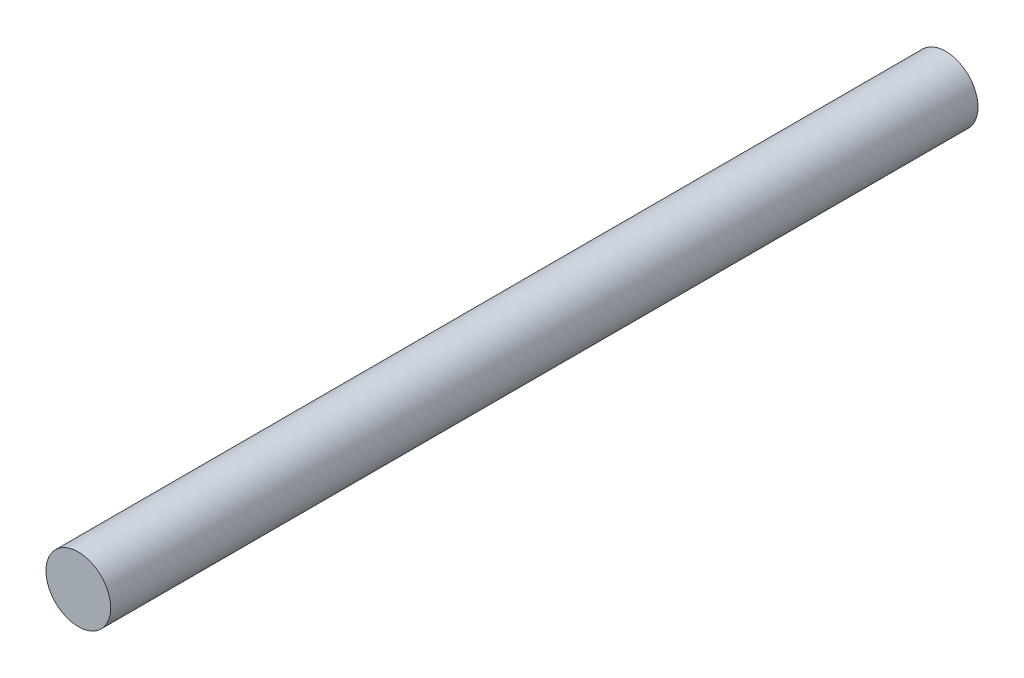
ISO-10303-21;
HEADER;
FILE_DESCRIPTION(('STEP AP214'),'2;1');
FILE_NAME('part.step','',(''),(''),'','','');
FILE_SCHEMA(('AUTOMOTIVE_DESIGN { 1 0 10303 214 1 1 1 1 }'));
ENDSEC;
DATA;
#1=APPLICATION_CONTEXT('core data for automotive mechanical design processes');
#2=APPLICATION_PROTOCOL_DEFINITION('international standard','automotive_design',2000,#1);
#3=PRODUCT_CONTEXT('',#1,'mechanical');
#4=PRODUCT('Part','Part','',(#3));
#5=PRODUCT_RELATED_PRODUCT_CATEGORY('part','',(#4));
#6=PRODUCT_DEFINITION_FORMATION('','',#4);
#7=PRODUCT_DEFINITION_CONTEXT('part definition',#1,'design');
#8=PRODUCT_DEFINITION('design','',#6,#7);
#9=PRODUCT_DEFINITION_SHAPE('','',#8);
#10=(LENGTH_UNIT() NAMED_UNIT(*) SI_UNIT(.MILLI.,.METRE.));
#11=(NAMED_UNIT(*) PLANE_ANGLE_UNIT() SI_UNIT($,.RADIAN.));
#12=(NAMED_UNIT(*) SI_UNIT($,.STERADIAN.) SOLID_ANGLE_UNIT());
#13=UNCERTAINTY_MEASURE_WITH_UNIT(LENGTH_MEASURE(1.E-05),#10,'distance_accuracy_value','');
#14=(GEOMETRIC_REPRESENTATION_CONTEXT(3) GLOBAL_UNCERTAINTY_ASSIGNED_CONTEXT((#13)) GLOBAL_UNIT_ASSIGNED_CONTEXT((#10,
#11,#12)) REPRESENTATION_CONTEXT('',''));
#15=CARTESIAN_POINT('',(0.,0.,0.));
#16=DIRECTION('',(0.,0.,1.));
#17=DIRECTION('',(1.,0.,0.));
#18=AXIS2_PLACEMENT_3D('',#15,#16,#17);
#19=CARTESIAN_POINT('',(0.,0.,-33.5));
#20=DIRECTION('',(0.,0.,1.));
#21=DIRECTION('',(1.,0.,0.));
#22=AXIS2_PLACEMENT_3D('',#19,#20,#21);
#23=CYLINDRICAL_SURFACE('',#22,2.5);
#24=CARTESIAN_POINT('',(0.,0.,-33.5));
#25=DIRECTION('',(0.,0.,1.));
#26=DIRECTION('',(1.,0.,0.));
#27=AXIS2_PLACEMENT_3D('',#24,#25,#26);
#28=CIRCLE('',#27,2.5);
#29=CARTESIAN_POINT('',(2.5,0.,-33.5));
#30=VERTEX_POINT('',#29);
#31=EDGE_CURVE('E10',#30,#30,#28,.T.);
#32=ORIENTED_EDGE('',*,*,#31,.T.);
#33=EDGE_LOOP('',(#32));
#34=FACE_BOUND('',#33,.T.);
#35=CARTESIAN_POINT('',(0.,0.,33.5));
#36=DIRECTION('',(0.,0.,1.));
#37=DIRECTION('',(1.,0.,0.));
#38=AXIS2_PLACEMENT_3D('',#35,#36,#37);
#39=CIRCLE('',#38,2.5);
#40=CARTESIAN_POINT('',(2.5,0.,33.5));
#41=VERTEX_POINT('',#40);
#42=EDGE_CURVE('E44',#41,#41,#39,.T.);
#43=ORIENTED_EDGE('',*,*,#42,.F.);
#44=EDGE_LOOP('',(#43));
#45=FACE_BOUND('',#44,.T.);
#46=ADVANCED_FACE('F37',(#34,#45),#23,.T.);
#47=CARTESIAN_POINT('',(0.,0.,-33.5));
#48=DIRECTION('',(0.,0.,1.));
#49=DIRECTION('',(1.,0.,0.));
#50=AXIS2_PLACEMENT_3D('',#47,#48,#49);
#51=PLANE('',#50);
#52=ORIENTED_EDGE('',*,*,#31,.F.);
#53=EDGE_LOOP('',(#52));
#54=FACE_BOUND('',#53,.T.);
#55=ADVANCED_FACE('F54',(#54),#51,.F.);
#56=CARTESIAN_POINT('',(0.,0.,33.5));
#57=DIRECTION('',(0.,0.,1.));
#58=DIRECTION('',(1.,0.,0.));
#59=AXIS2_PLACEMENT_3D('',#56,#57,#58);
#60=PLANE('',#59);
#61=ORIENTED_EDGE('',*,*,#42,.T.);
#62=EDGE_LOOP('',(#61));
#63=FACE_BOUND('',#62,.T.);
#64=ADVANCED_FACE('F51',(#63),#60,.T.);
#65=CLOSED_SHELL('',(#46,#55,#64));
#66=MANIFOLD_SOLID_BREP('B2',#65);
#67=ADVANCED_BREP_SHAPE_REPRESENTATION('',(#18,#66),#14);
#68=SHAPE_DEFINITION_REPRESENTATION(#9,#67);
ENDSEC;
END-ISO-10303-21;
